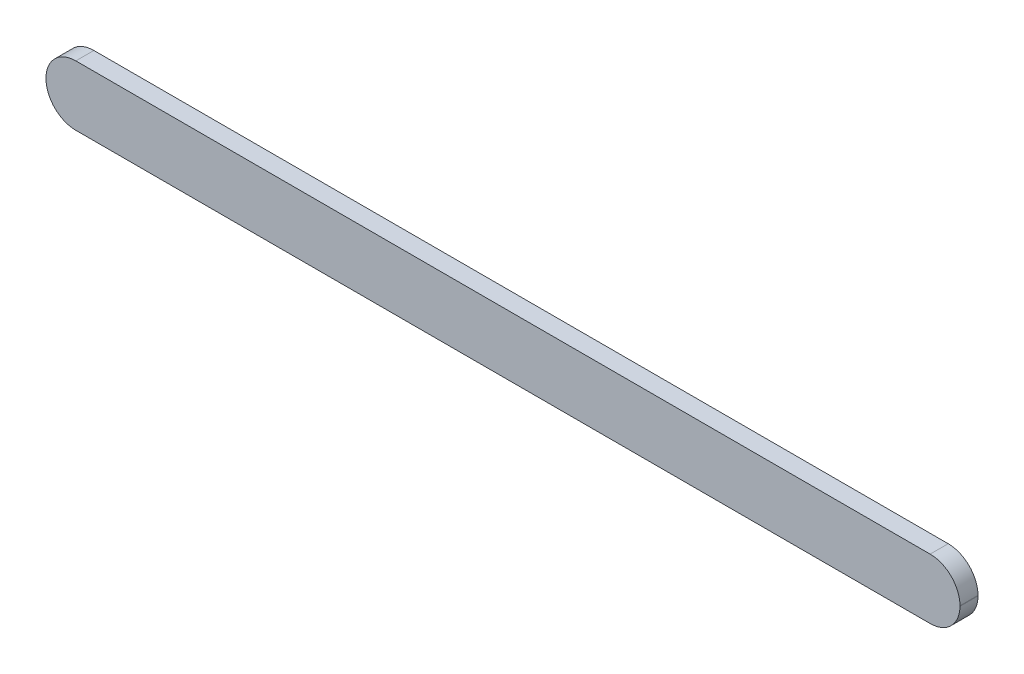
ISO-10303-21;
HEADER;
FILE_DESCRIPTION(('STEP AP214'),'2;1');
FILE_NAME('part.step','',(''),(''),'','','');
FILE_SCHEMA(('AUTOMOTIVE_DESIGN { 1 0 10303 214 1 1 1 1 }'));
ENDSEC;
DATA;
#1=APPLICATION_CONTEXT('core data for automotive mechanical design processes');
#2=APPLICATION_PROTOCOL_DEFINITION('international standard','automotive_design',2000,#1);
#3=PRODUCT_CONTEXT('',#1,'mechanical');
#4=PRODUCT('Part','Part','',(#3));
#5=PRODUCT_RELATED_PRODUCT_CATEGORY('part','',(#4));
#6=PRODUCT_DEFINITION_FORMATION('','',#4);
#7=PRODUCT_DEFINITION_CONTEXT('part definition',#1,'design');
#8=PRODUCT_DEFINITION('design','',#6,#7);
#9=PRODUCT_DEFINITION_SHAPE('','',#8);
#10=(LENGTH_UNIT() NAMED_UNIT(*) SI_UNIT(.MILLI.,.METRE.));
#11=(NAMED_UNIT(*) PLANE_ANGLE_UNIT() SI_UNIT($,.RADIAN.));
#12=(NAMED_UNIT(*) SI_UNIT($,.STERADIAN.) SOLID_ANGLE_UNIT());
#13=UNCERTAINTY_MEASURE_WITH_UNIT(LENGTH_MEASURE(1.E-05),#10,'distance_accuracy_value','');
#14=(GEOMETRIC_REPRESENTATION_CONTEXT(3) GLOBAL_UNCERTAINTY_ASSIGNED_CONTEXT((#13)) GLOBAL_UNIT_ASSIGNED_CONTEXT((#10,
#11,#12)) REPRESENTATION_CONTEXT('',''));
#15=CARTESIAN_POINT('',(0.,0.,0.));
#16=DIRECTION('',(0.,0.,1.));
#17=DIRECTION('',(1.,0.,0.));
#18=AXIS2_PLACEMENT_3D('',#15,#16,#17);
#19=CARTESIAN_POINT('',(933.704,-32.004,0.));
#20=DIRECTION('',(0.,0.,-1.));
#21=DIRECTION('',(-1.,0.,0.));
#22=AXIS2_PLACEMENT_3D('',#19,#20,#21);
#23=PLANE('',#22);
#24=CARTESIAN_POINT('',(241.3,-31.7500000000042,0.));
#25=DIRECTION('',(0.,0.,1.));
#26=DIRECTION('',(1.,0.,0.));
#27=AXIS2_PLACEMENT_3D('',#24,#25,#26);
#28=CIRCLE('',#27,16.66875);
#29=CARTESIAN_POINT('',(257.96875,-31.7500000000042,0.));
#30=VERTEX_POINT('',#29);
#31=EDGE_CURVE('E208',#30,#30,#28,.T.);
#32=ORIENTED_EDGE('',*,*,#31,.T.);
#33=EDGE_LOOP('',(#32));
#34=FACE_BOUND('',#33,.T.);
#35=CARTESIAN_POINT('',(482.6,-31.7500000000025,0.));
#36=DIRECTION('',(0.,0.,1.));
#37=DIRECTION('',(1.,0.,0.));
#38=AXIS2_PLACEMENT_3D('',#35,#36,#37);
#39=CIRCLE('',#38,16.66875);
#40=CARTESIAN_POINT('',(499.26875,-31.7500000000025,0.));
#41=VERTEX_POINT('',#40);
#42=EDGE_CURVE('E196',#41,#41,#39,.T.);
#43=ORIENTED_EDGE('',*,*,#42,.T.);
#44=EDGE_LOOP('',(#43));
#45=FACE_BOUND('',#44,.T.);
#46=CARTESIAN_POINT('',(723.9,-31.7500000000008,0.));
#47=DIRECTION('',(0.,0.,1.));
#48=DIRECTION('',(1.,0.,0.));
#49=AXIS2_PLACEMENT_3D('',#46,#47,#48);
#50=CIRCLE('',#49,16.66875);
#51=CARTESIAN_POINT('',(740.56875,-31.7500000000008,0.));
#52=VERTEX_POINT('',#51);
#53=EDGE_CURVE('E184',#52,#52,#50,.T.);
#54=ORIENTED_EDGE('',*,*,#53,.T.);
#55=EDGE_LOOP('',(#54));
#56=FACE_BOUND('',#55,.T.);
#57=CARTESIAN_POINT('',(933.704,-32.004,0.));
#58=DIRECTION('',(0.,0.,1.));
#59=DIRECTION('',(-1.,0.,0.));
#60=AXIS2_PLACEMENT_3D('',#57,#58,#59);
#61=CIRCLE('',#60,31.4959999999999);
#62=CARTESIAN_POINT('',(933.704,-63.5,0.));
#63=VERTEX_POINT('',#62);
#64=CARTESIAN_POINT('',(965.2,-32.004,0.));
#65=VERTEX_POINT('',#64);
#66=EDGE_CURVE('E130',#63,#65,#61,.T.);
#67=ORIENTED_EDGE('',*,*,#66,.F.);
#68=DIRECTION('',(1.,0.,0.));
#69=VECTOR('',#68,1.);
#70=CARTESIAN_POINT('',(31.496,-63.5,0.));
#71=LINE('',#70,#69);
#72=CARTESIAN_POINT('',(31.496,-63.5,0.));
#73=VERTEX_POINT('',#72);
#74=EDGE_CURVE('E85',#73,#63,#71,.T.);
#75=ORIENTED_EDGE('',*,*,#74,.F.);
#76=CARTESIAN_POINT('',(31.496,-32.004,0.));
#77=DIRECTION('',(0.,0.,1.));
#78=DIRECTION('',(1.,0.,0.));
#79=AXIS2_PLACEMENT_3D('',#76,#77,#78);
#80=CIRCLE('',#79,31.496);
#81=CARTESIAN_POINT('',(0.,-32.004,0.));
#82=VERTEX_POINT('',#81);
#83=EDGE_CURVE('E79',#82,#73,#80,.T.);
#84=ORIENTED_EDGE('',*,*,#83,.F.);
#85=DIRECTION('',(0.,-1.,0.));
#86=VECTOR('',#85,1.);
#87=CARTESIAN_POINT('',(0.,-31.496,0.));
#88=LINE('',#87,#86);
#89=CARTESIAN_POINT('',(0.,-31.496,0.));
#90=VERTEX_POINT('',#89);
#91=EDGE_CURVE('E120',#90,#82,#88,.T.);
#92=ORIENTED_EDGE('',*,*,#91,.F.);
#93=CARTESIAN_POINT('',(31.496,-31.496,0.));
#94=DIRECTION('',(0.,0.,1.));
#95=DIRECTION('',(-1.,0.,0.));
#96=AXIS2_PLACEMENT_3D('',#93,#94,#95);
#97=CIRCLE('',#96,31.496);
#98=CARTESIAN_POINT('',(31.496,0.,0.));
#99=VERTEX_POINT('',#98);
#100=EDGE_CURVE('E140',#99,#90,#97,.T.);
#101=ORIENTED_EDGE('',*,*,#100,.F.);
#102=DIRECTION('',(-1.,0.,0.));
#103=VECTOR('',#102,1.);
#104=CARTESIAN_POINT('',(31.496,0.,0.));
#105=LINE('',#104,#103);
#106=CARTESIAN_POINT('',(933.704,0.,0.));
#107=VERTEX_POINT('',#106);
#108=EDGE_CURVE('E138',#107,#99,#105,.T.);
#109=ORIENTED_EDGE('',*,*,#108,.F.);
#110=CARTESIAN_POINT('',(933.704,-31.496,0.));
#111=DIRECTION('',(0.,0.,1.));
#112=DIRECTION('',(1.,0.,0.));
#113=AXIS2_PLACEMENT_3D('',#110,#111,#112);
#114=CIRCLE('',#113,31.4959999999999);
#115=CARTESIAN_POINT('',(965.2,-31.496,0.));
#116=VERTEX_POINT('',#115);
#117=EDGE_CURVE('E136',#116,#107,#114,.T.);
#118=ORIENTED_EDGE('',*,*,#117,.F.);
#119=DIRECTION('',(0.,1.,0.));
#120=VECTOR('',#119,1.);
#121=CARTESIAN_POINT('',(965.2,-31.496,0.));
#122=LINE('',#121,#120);
#123=EDGE_CURVE('E133',#65,#116,#122,.T.);
#124=ORIENTED_EDGE('',*,*,#123,.F.);
#125=EDGE_LOOP('',(#67,#75,#84,#92,#101,#109,#118,#124));
#126=FACE_BOUND('',#125,.T.);
#127=CARTESIAN_POINT('',(844.55,-31.75,0.));
#128=DIRECTION('',(0.,0.,1.));
#129=DIRECTION('',(1.,0.,0.));
#130=AXIS2_PLACEMENT_3D('',#127,#128,#129);
#131=CIRCLE('',#130,16.66875);
#132=CARTESIAN_POINT('',(861.21875,-31.75,0.));
#133=VERTEX_POINT('',#132);
#134=EDGE_CURVE('E178',#133,#133,#131,.T.);
#135=ORIENTED_EDGE('',*,*,#134,.T.);
#136=EDGE_LOOP('',(#135));
#137=FACE_BOUND('',#136,.T.);
#138=CARTESIAN_POINT('',(603.25,-31.7500000000017,0.));
#139=DIRECTION('',(0.,0.,1.));
#140=DIRECTION('',(1.,0.,0.));
#141=AXIS2_PLACEMENT_3D('',#138,#139,#140);
#142=CIRCLE('',#141,16.66875);
#143=CARTESIAN_POINT('',(619.91875,-31.7500000000017,0.));
#144=VERTEX_POINT('',#143);
#145=EDGE_CURVE('E190',#144,#144,#142,.T.);
#146=ORIENTED_EDGE('',*,*,#145,.T.);
#147=EDGE_LOOP('',(#146));
#148=FACE_BOUND('',#147,.T.);
#149=CARTESIAN_POINT('',(361.95,-31.7500000000034,0.));
#150=DIRECTION('',(0.,0.,1.));
#151=DIRECTION('',(1.,0.,0.));
#152=AXIS2_PLACEMENT_3D('',#149,#150,#151);
#153=CIRCLE('',#152,16.66875);
#154=CARTESIAN_POINT('',(378.61875,-31.7500000000034,0.));
#155=VERTEX_POINT('',#154);
#156=EDGE_CURVE('E202',#155,#155,#153,.T.);
#157=ORIENTED_EDGE('',*,*,#156,.T.);
#158=EDGE_LOOP('',(#157));
#159=FACE_BOUND('',#158,.T.);
#160=CARTESIAN_POINT('',(120.65,-31.750000000005,0.));
#161=DIRECTION('',(0.,0.,1.));
#162=DIRECTION('',(1.,0.,0.));
#163=AXIS2_PLACEMENT_3D('',#160,#161,#162);
#164=CIRCLE('',#163,16.66875);
#165=CARTESIAN_POINT('',(137.31875,-31.750000000005,0.));
#166=VERTEX_POINT('',#165);
#167=EDGE_CURVE('E214',#166,#166,#164,.T.);
#168=ORIENTED_EDGE('',*,*,#167,.T.);
#169=EDGE_LOOP('',(#168));
#170=FACE_BOUND('',#169,.T.);
#171=ADVANCED_FACE('F33',(#34,#45,#56,#126,#137,#148,#159,#170),#23,.T.);
#172=CARTESIAN_POINT('',(933.704,-32.004,19.05));
#173=DIRECTION('',(0.,0.,-1.));
#174=DIRECTION('',(-1.,0.,0.));
#175=AXIS2_PLACEMENT_3D('',#172,#173,#174);
#176=CYLINDRICAL_SURFACE('',#175,31.4959999999999);
#177=ORIENTED_EDGE('',*,*,#66,.T.);
#178=DIRECTION('',(0.,0.,-1.));
#179=VECTOR('',#178,1.);
#180=CARTESIAN_POINT('',(965.2,-32.004,19.05));
#181=LINE('',#180,#179);
#182=CARTESIAN_POINT('',(965.2,-32.004,19.05));
#183=VERTEX_POINT('',#182);
#184=EDGE_CURVE('E11',#183,#65,#181,.T.);
#185=ORIENTED_EDGE('',*,*,#184,.F.);
#186=CARTESIAN_POINT('',(933.704,-32.004,19.05));
#187=DIRECTION('',(0.,0.,1.));
#188=DIRECTION('',(-1.,0.,0.));
#189=AXIS2_PLACEMENT_3D('',#186,#187,#188);
#190=CIRCLE('',#189,31.4959999999999);
#191=CARTESIAN_POINT('',(933.704,-63.5,19.05));
#192=VERTEX_POINT('',#191);
#193=EDGE_CURVE('E145',#192,#183,#190,.T.);
#194=ORIENTED_EDGE('',*,*,#193,.F.);
#195=DIRECTION('',(0.,0.,-1.));
#196=VECTOR('',#195,1.);
#197=CARTESIAN_POINT('',(933.704,-63.5,19.05));
#198=LINE('',#197,#196);
#199=EDGE_CURVE('E126',#192,#63,#198,.T.);
#200=ORIENTED_EDGE('',*,*,#199,.T.);
#201=EDGE_LOOP('',(#177,#185,#194,#200));
#202=FACE_BOUND('',#201,.T.);
#203=ADVANCED_FACE('F35',(#202),#176,.T.);
#204=CARTESIAN_POINT('',(965.2,-31.496,19.05));
#205=DIRECTION('',(-1.,0.,0.));
#206=DIRECTION('',(0.,0.,1.));
#207=AXIS2_PLACEMENT_3D('',#204,#205,#206);
#208=PLANE('',#207);
#209=ORIENTED_EDGE('',*,*,#123,.T.);
#210=DIRECTION('',(0.,0.,-1.));
#211=VECTOR('',#210,1.);
#212=CARTESIAN_POINT('',(965.2,-31.496,19.05));
#213=LINE('',#212,#211);
#214=CARTESIAN_POINT('',(965.2,-31.496,19.05));
#215=VERTEX_POINT('',#214);
#216=EDGE_CURVE('E42',#215,#116,#213,.T.);
#217=ORIENTED_EDGE('',*,*,#216,.F.);
#218=DIRECTION('',(0.,1.,0.));
#219=VECTOR('',#218,1.);
#220=CARTESIAN_POINT('',(965.2,-31.496,19.05));
#221=LINE('',#220,#219);
#222=EDGE_CURVE('E93',#183,#215,#221,.T.);
#223=ORIENTED_EDGE('',*,*,#222,.F.);
#224=ORIENTED_EDGE('',*,*,#184,.T.);
#225=EDGE_LOOP('',(#209,#217,#223,#224));
#226=FACE_BOUND('',#225,.T.);
#227=ADVANCED_FACE('F237',(#226),#208,.F.);
#228=CARTESIAN_POINT('',(933.704,-31.496,19.05));
#229=DIRECTION('',(0.,0.,-1.));
#230=DIRECTION('',(-1.,0.,0.));
#231=AXIS2_PLACEMENT_3D('',#228,#229,#230);
#232=CYLINDRICAL_SURFACE('',#231,31.4959999999999);
#233=ORIENTED_EDGE('',*,*,#117,.T.);
#234=DIRECTION('',(0.,0.,-1.));
#235=VECTOR('',#234,1.);
#236=CARTESIAN_POINT('',(933.704,0.,19.05));
#237=LINE('',#236,#235);
#238=CARTESIAN_POINT('',(933.704,0.,19.05));
#239=VERTEX_POINT('',#238);
#240=EDGE_CURVE('E152',#239,#107,#237,.T.);
#241=ORIENTED_EDGE('',*,*,#240,.F.);
#242=CARTESIAN_POINT('',(933.704,-31.496,19.05));
#243=DIRECTION('',(0.,0.,1.));
#244=DIRECTION('',(1.,0.,0.));
#245=AXIS2_PLACEMENT_3D('',#242,#243,#244);
#246=CIRCLE('',#245,31.4959999999999);
#247=EDGE_CURVE('E160',#215,#239,#246,.T.);
#248=ORIENTED_EDGE('',*,*,#247,.F.);
#249=ORIENTED_EDGE('',*,*,#216,.T.);
#250=EDGE_LOOP('',(#233,#241,#248,#249));
#251=FACE_BOUND('',#250,.T.);
#252=ADVANCED_FACE('F158',(#251),#232,.T.);
#253=CARTESIAN_POINT('',(31.496,0.,19.05));
#254=DIRECTION('',(0.,-1.,0.));
#255=DIRECTION('',(0.,0.,-1.));
#256=AXIS2_PLACEMENT_3D('',#253,#254,#255);
#257=PLANE('',#256);
#258=ORIENTED_EDGE('',*,*,#108,.T.);
#259=DIRECTION('',(0.,0.,-1.));
#260=VECTOR('',#259,1.);
#261=CARTESIAN_POINT('',(31.496,0.,19.05));
#262=LINE('',#261,#260);
#263=CARTESIAN_POINT('',(31.496,0.,19.05));
#264=VERTEX_POINT('',#263);
#265=EDGE_CURVE('E149',#264,#99,#262,.T.);
#266=ORIENTED_EDGE('',*,*,#265,.F.);
#267=DIRECTION('',(-1.,0.,0.));
#268=VECTOR('',#267,1.);
#269=CARTESIAN_POINT('',(31.496,0.,19.05));
#270=LINE('',#269,#268);
#271=EDGE_CURVE('E172',#239,#264,#270,.T.);
#272=ORIENTED_EDGE('',*,*,#271,.F.);
#273=ORIENTED_EDGE('',*,*,#240,.T.);
#274=EDGE_LOOP('',(#258,#266,#272,#273));
#275=FACE_BOUND('',#274,.T.);
#276=ADVANCED_FACE('F168',(#275),#257,.F.);
#277=CARTESIAN_POINT('',(31.496,-31.496,19.05));
#278=DIRECTION('',(0.,0.,-1.));
#279=DIRECTION('',(-1.,0.,0.));
#280=AXIS2_PLACEMENT_3D('',#277,#278,#279);
#281=CYLINDRICAL_SURFACE('',#280,31.496);
#282=ORIENTED_EDGE('',*,*,#100,.T.);
#283=DIRECTION('',(0.,0.,-1.));
#284=VECTOR('',#283,1.);
#285=CARTESIAN_POINT('',(0.,-31.496,19.05));
#286=LINE('',#285,#284);
#287=CARTESIAN_POINT('',(0.,-31.496,19.05));
#288=VERTEX_POINT('',#287);
#289=EDGE_CURVE('E121',#288,#90,#286,.T.);
#290=ORIENTED_EDGE('',*,*,#289,.F.);
#291=CARTESIAN_POINT('',(31.496,-31.496,19.05));
#292=DIRECTION('',(0.,0.,1.));
#293=DIRECTION('',(-1.,0.,0.));
#294=AXIS2_PLACEMENT_3D('',#291,#292,#293);
#295=CIRCLE('',#294,31.496);
#296=EDGE_CURVE('E112',#264,#288,#295,.T.);
#297=ORIENTED_EDGE('',*,*,#296,.F.);
#298=ORIENTED_EDGE('',*,*,#265,.T.);
#299=EDGE_LOOP('',(#282,#290,#297,#298));
#300=FACE_BOUND('',#299,.T.);
#301=ADVANCED_FACE('F171',(#300),#281,.T.);
#302=CARTESIAN_POINT('',(0.,-31.496,19.05));
#303=DIRECTION('',(1.,0.,0.));
#304=DIRECTION('',(0.,0.,-1.));
#305=AXIS2_PLACEMENT_3D('',#302,#303,#304);
#306=PLANE('',#305);
#307=ORIENTED_EDGE('',*,*,#91,.T.);
#308=DIRECTION('',(0.,0.,-1.));
#309=VECTOR('',#308,1.);
#310=CARTESIAN_POINT('',(0.,-32.004,19.05));
#311=LINE('',#310,#309);
#312=CARTESIAN_POINT('',(0.,-32.004,19.05));
#313=VERTEX_POINT('',#312);
#314=EDGE_CURVE('E117',#313,#82,#311,.T.);
#315=ORIENTED_EDGE('',*,*,#314,.F.);
#316=DIRECTION('',(0.,-1.,0.));
#317=VECTOR('',#316,1.);
#318=CARTESIAN_POINT('',(0.,-31.496,19.05));
#319=LINE('',#318,#317);
#320=EDGE_CURVE('E106',#288,#313,#319,.T.);
#321=ORIENTED_EDGE('',*,*,#320,.F.);
#322=ORIENTED_EDGE('',*,*,#289,.T.);
#323=EDGE_LOOP('',(#307,#315,#321,#322));
#324=FACE_BOUND('',#323,.T.);
#325=ADVANCED_FACE('F118',(#324),#306,.F.);
#326=CARTESIAN_POINT('',(31.496,-32.004,19.05));
#327=DIRECTION('',(0.,0.,-1.));
#328=DIRECTION('',(-1.,0.,0.));
#329=AXIS2_PLACEMENT_3D('',#326,#327,#328);
#330=CYLINDRICAL_SURFACE('',#329,31.496);
#331=ORIENTED_EDGE('',*,*,#83,.T.);
#332=DIRECTION('',(0.,0.,-1.));
#333=VECTOR('',#332,1.);
#334=CARTESIAN_POINT('',(31.496,-63.5,19.05));
#335=LINE('',#334,#333);
#336=CARTESIAN_POINT('',(31.496,-63.5,19.05));
#337=VERTEX_POINT('',#336);
#338=EDGE_CURVE('E122',#337,#73,#335,.T.);
#339=ORIENTED_EDGE('',*,*,#338,.F.);
#340=CARTESIAN_POINT('',(31.496,-32.004,19.05));
#341=DIRECTION('',(0.,0.,1.));
#342=DIRECTION('',(1.,0.,0.));
#343=AXIS2_PLACEMENT_3D('',#340,#341,#342);
#344=CIRCLE('',#343,31.496);
#345=EDGE_CURVE('E110',#313,#337,#344,.T.);
#346=ORIENTED_EDGE('',*,*,#345,.F.);
#347=ORIENTED_EDGE('',*,*,#314,.T.);
#348=EDGE_LOOP('',(#331,#339,#346,#347));
#349=FACE_BOUND('',#348,.T.);
#350=ADVANCED_FACE('F124',(#349),#330,.T.);
#351=CARTESIAN_POINT('',(31.496,-63.5,19.05));
#352=DIRECTION('',(0.,1.,0.));
#353=DIRECTION('',(-1.,0.,0.));
#354=AXIS2_PLACEMENT_3D('',#351,#352,#353);
#355=PLANE('',#354);
#356=ORIENTED_EDGE('',*,*,#74,.T.);
#357=ORIENTED_EDGE('',*,*,#199,.F.);
#358=DIRECTION('',(1.,0.,0.));
#359=VECTOR('',#358,1.);
#360=CARTESIAN_POINT('',(31.496,-63.5,19.05));
#361=LINE('',#360,#359);
#362=EDGE_CURVE('E50',#337,#192,#361,.T.);
#363=ORIENTED_EDGE('',*,*,#362,.F.);
#364=ORIENTED_EDGE('',*,*,#338,.T.);
#365=EDGE_LOOP('',(#356,#357,#363,#364));
#366=FACE_BOUND('',#365,.T.);
#367=ADVANCED_FACE('F243',(#366),#355,.F.);
#368=CARTESIAN_POINT('',(933.704,-32.004,19.05));
#369=DIRECTION('',(0.,0.,-1.));
#370=DIRECTION('',(-1.,0.,0.));
#371=AXIS2_PLACEMENT_3D('',#368,#369,#370);
#372=PLANE('',#371);
#373=ORIENTED_EDGE('',*,*,#193,.T.);
#374=ORIENTED_EDGE('',*,*,#222,.T.);
#375=ORIENTED_EDGE('',*,*,#247,.T.);
#376=ORIENTED_EDGE('',*,*,#271,.T.);
#377=ORIENTED_EDGE('',*,*,#296,.T.);
#378=ORIENTED_EDGE('',*,*,#320,.T.);
#379=ORIENTED_EDGE('',*,*,#345,.T.);
#380=ORIENTED_EDGE('',*,*,#362,.T.);
#381=EDGE_LOOP('',(#373,#374,#375,#376,#377,#378,#379,#380));
#382=FACE_BOUND('',#381,.T.);
#383=ADVANCED_FACE('F108',(#382),#372,.F.);
#384=CARTESIAN_POINT('',(844.55,-31.75,9.525));
#385=DIRECTION('',(0.,0.,-1.));
#386=DIRECTION('',(-1.,0.,0.));
#387=AXIS2_PLACEMENT_3D('',#384,#385,#386);
#388=CYLINDRICAL_SURFACE('',#387,16.66875);
#389=CARTESIAN_POINT('',(844.55,-31.75,9.525));
#390=DIRECTION('',(0.,0.,1.));
#391=DIRECTION('',(1.,0.,0.));
#392=AXIS2_PLACEMENT_3D('',#389,#390,#391);
#393=CIRCLE('',#392,16.66875);
#394=CARTESIAN_POINT('',(861.21875,-31.75,9.525));
#395=VERTEX_POINT('',#394);
#396=EDGE_CURVE('E134',#395,#395,#393,.T.);
#397=ORIENTED_EDGE('',*,*,#396,.T.);
#398=EDGE_LOOP('',(#397));
#399=FACE_BOUND('',#398,.T.);
#400=ORIENTED_EDGE('',*,*,#134,.F.);
#401=EDGE_LOOP('',(#400));
#402=FACE_BOUND('',#401,.T.);
#403=ADVANCED_FACE('F292',(#399,#402),#388,.F.);
#404=CARTESIAN_POINT('',(844.55,-31.75,9.525));
#405=DIRECTION('',(0.,0.,1.));
#406=DIRECTION('',(1.,0.,0.));
#407=AXIS2_PLACEMENT_3D('',#404,#405,#406);
#408=PLANE('',#407);
#409=ORIENTED_EDGE('',*,*,#396,.F.);
#410=EDGE_LOOP('',(#409));
#411=FACE_BOUND('',#410,.T.);
#412=ADVANCED_FACE('F298',(#411),#408,.F.);
#413=CARTESIAN_POINT('',(723.9,-31.7500000000008,9.525));
#414=DIRECTION('',(0.,0.,-1.));
#415=DIRECTION('',(-1.,0.,0.));
#416=AXIS2_PLACEMENT_3D('',#413,#414,#415);
#417=CYLINDRICAL_SURFACE('',#416,16.66875);
#418=CARTESIAN_POINT('',(723.9,-31.7500000000008,9.525));
#419=DIRECTION('',(0.,0.,1.));
#420=DIRECTION('',(1.,0.,0.));
#421=AXIS2_PLACEMENT_3D('',#418,#419,#420);
#422=CIRCLE('',#421,16.66875);
#423=CARTESIAN_POINT('',(740.56875,-31.7500000000008,9.525));
#424=VERTEX_POINT('',#423);
#425=EDGE_CURVE('E181',#424,#424,#422,.T.);
#426=ORIENTED_EDGE('',*,*,#425,.T.);
#427=EDGE_LOOP('',(#426));
#428=FACE_BOUND('',#427,.T.);
#429=ORIENTED_EDGE('',*,*,#53,.F.);
#430=EDGE_LOOP('',(#429));
#431=FACE_BOUND('',#430,.T.);
#432=ADVANCED_FACE('F305',(#428,#431),#417,.F.);
#433=CARTESIAN_POINT('',(723.9,-31.7500000000008,9.525));
#434=DIRECTION('',(0.,0.,1.));
#435=DIRECTION('',(1.,0.,0.));
#436=AXIS2_PLACEMENT_3D('',#433,#434,#435);
#437=PLANE('',#436);
#438=ORIENTED_EDGE('',*,*,#425,.F.);
#439=EDGE_LOOP('',(#438));
#440=FACE_BOUND('',#439,.T.);
#441=ADVANCED_FACE('F313',(#440),#437,.F.);
#442=CARTESIAN_POINT('',(603.25,-31.7500000000017,9.525));
#443=DIRECTION('',(0.,0.,-1.));
#444=DIRECTION('',(-1.,0.,0.));
#445=AXIS2_PLACEMENT_3D('',#442,#443,#444);
#446=CYLINDRICAL_SURFACE('',#445,16.66875);
#447=CARTESIAN_POINT('',(603.25,-31.7500000000017,9.525));
#448=DIRECTION('',(0.,0.,1.));
#449=DIRECTION('',(1.,0.,0.));
#450=AXIS2_PLACEMENT_3D('',#447,#448,#449);
#451=CIRCLE('',#450,16.66875);
#452=CARTESIAN_POINT('',(619.91875,-31.7500000000017,9.525));
#453=VERTEX_POINT('',#452);
#454=EDGE_CURVE('E187',#453,#453,#451,.T.);
#455=ORIENTED_EDGE('',*,*,#454,.T.);
#456=EDGE_LOOP('',(#455));
#457=FACE_BOUND('',#456,.T.);
#458=ORIENTED_EDGE('',*,*,#145,.F.);
#459=EDGE_LOOP('',(#458));
#460=FACE_BOUND('',#459,.T.);
#461=ADVANCED_FACE('F321',(#457,#460),#446,.F.);
#462=CARTESIAN_POINT('',(603.25,-31.7500000000017,9.525));
#463=DIRECTION('',(0.,0.,1.));
#464=DIRECTION('',(1.,0.,0.));
#465=AXIS2_PLACEMENT_3D('',#462,#463,#464);
#466=PLANE('',#465);
#467=ORIENTED_EDGE('',*,*,#454,.F.);
#468=EDGE_LOOP('',(#467));
#469=FACE_BOUND('',#468,.T.);
#470=ADVANCED_FACE('F329',(#469),#466,.F.);
#471=CARTESIAN_POINT('',(482.6,-31.7500000000025,9.525));
#472=DIRECTION('',(0.,0.,-1.));
#473=DIRECTION('',(-1.,0.,0.));
#474=AXIS2_PLACEMENT_3D('',#471,#472,#473);
#475=CYLINDRICAL_SURFACE('',#474,16.66875);
#476=CARTESIAN_POINT('',(482.6,-31.7500000000025,9.525));
#477=DIRECTION('',(0.,0.,1.));
#478=DIRECTION('',(1.,0.,0.));
#479=AXIS2_PLACEMENT_3D('',#476,#477,#478);
#480=CIRCLE('',#479,16.66875);
#481=CARTESIAN_POINT('',(499.26875,-31.7500000000025,9.525));
#482=VERTEX_POINT('',#481);
#483=EDGE_CURVE('E193',#482,#482,#480,.T.);
#484=ORIENTED_EDGE('',*,*,#483,.T.);
#485=EDGE_LOOP('',(#484));
#486=FACE_BOUND('',#485,.T.);
#487=ORIENTED_EDGE('',*,*,#42,.F.);
#488=EDGE_LOOP('',(#487));
#489=FACE_BOUND('',#488,.T.);
#490=ADVANCED_FACE('F337',(#486,#489),#475,.F.);
#491=CARTESIAN_POINT('',(482.6,-31.7500000000025,9.525));
#492=DIRECTION('',(0.,0.,1.));
#493=DIRECTION('',(1.,0.,0.));
#494=AXIS2_PLACEMENT_3D('',#491,#492,#493);
#495=PLANE('',#494);
#496=ORIENTED_EDGE('',*,*,#483,.F.);
#497=EDGE_LOOP('',(#496));
#498=FACE_BOUND('',#497,.T.);
#499=ADVANCED_FACE('F345',(#498),#495,.F.);
#500=CARTESIAN_POINT('',(361.95,-31.7500000000034,9.525));
#501=DIRECTION('',(0.,0.,-1.));
#502=DIRECTION('',(-1.,0.,0.));
#503=AXIS2_PLACEMENT_3D('',#500,#501,#502);
#504=CYLINDRICAL_SURFACE('',#503,16.66875);
#505=CARTESIAN_POINT('',(361.95,-31.7500000000034,9.525));
#506=DIRECTION('',(0.,0.,1.));
#507=DIRECTION('',(1.,0.,0.));
#508=AXIS2_PLACEMENT_3D('',#505,#506,#507);
#509=CIRCLE('',#508,16.66875);
#510=CARTESIAN_POINT('',(378.61875,-31.7500000000034,9.525));
#511=VERTEX_POINT('',#510);
#512=EDGE_CURVE('E199',#511,#511,#509,.T.);
#513=ORIENTED_EDGE('',*,*,#512,.T.);
#514=EDGE_LOOP('',(#513));
#515=FACE_BOUND('',#514,.T.);
#516=ORIENTED_EDGE('',*,*,#156,.F.);
#517=EDGE_LOOP('',(#516));
#518=FACE_BOUND('',#517,.T.);
#519=ADVANCED_FACE('F353',(#515,#518),#504,.F.);
#520=CARTESIAN_POINT('',(361.95,-31.7500000000034,9.525));
#521=DIRECTION('',(0.,0.,1.));
#522=DIRECTION('',(1.,0.,0.));
#523=AXIS2_PLACEMENT_3D('',#520,#521,#522);
#524=PLANE('',#523);
#525=ORIENTED_EDGE('',*,*,#512,.F.);
#526=EDGE_LOOP('',(#525));
#527=FACE_BOUND('',#526,.T.);
#528=ADVANCED_FACE('F361',(#527),#524,.F.);
#529=CARTESIAN_POINT('',(241.3,-31.7500000000042,9.525));
#530=DIRECTION('',(0.,0.,-1.));
#531=DIRECTION('',(-1.,0.,0.));
#532=AXIS2_PLACEMENT_3D('',#529,#530,#531);
#533=CYLINDRICAL_SURFACE('',#532,16.66875);
#534=CARTESIAN_POINT('',(241.3,-31.7500000000042,9.525));
#535=DIRECTION('',(0.,0.,1.));
#536=DIRECTION('',(1.,0.,0.));
#537=AXIS2_PLACEMENT_3D('',#534,#535,#536);
#538=CIRCLE('',#537,16.66875);
#539=CARTESIAN_POINT('',(257.96875,-31.7500000000042,9.525));
#540=VERTEX_POINT('',#539);
#541=EDGE_CURVE('E205',#540,#540,#538,.T.);
#542=ORIENTED_EDGE('',*,*,#541,.T.);
#543=EDGE_LOOP('',(#542));
#544=FACE_BOUND('',#543,.T.);
#545=ORIENTED_EDGE('',*,*,#31,.F.);
#546=EDGE_LOOP('',(#545));
#547=FACE_BOUND('',#546,.T.);
#548=ADVANCED_FACE('F369',(#544,#547),#533,.F.);
#549=CARTESIAN_POINT('',(241.3,-31.7500000000042,9.525));
#550=DIRECTION('',(0.,0.,1.));
#551=DIRECTION('',(1.,0.,0.));
#552=AXIS2_PLACEMENT_3D('',#549,#550,#551);
#553=PLANE('',#552);
#554=ORIENTED_EDGE('',*,*,#541,.F.);
#555=EDGE_LOOP('',(#554));
#556=FACE_BOUND('',#555,.T.);
#557=ADVANCED_FACE('F229',(#556),#553,.F.);
#558=CARTESIAN_POINT('',(120.65,-31.750000000005,9.525));
#559=DIRECTION('',(0.,0.,-1.));
#560=DIRECTION('',(-1.,0.,0.));
#561=AXIS2_PLACEMENT_3D('',#558,#559,#560);
#562=CYLINDRICAL_SURFACE('',#561,16.66875);
#563=CARTESIAN_POINT('',(120.65,-31.750000000005,9.525));
#564=DIRECTION('',(0.,0.,1.));
#565=DIRECTION('',(1.,0.,0.));
#566=AXIS2_PLACEMENT_3D('',#563,#564,#565);
#567=CIRCLE('',#566,16.66875);
#568=CARTESIAN_POINT('',(137.31875,-31.750000000005,9.525));
#569=VERTEX_POINT('',#568);
#570=EDGE_CURVE('E211',#569,#569,#567,.T.);
#571=ORIENTED_EDGE('',*,*,#570,.T.);
#572=EDGE_LOOP('',(#571));
#573=FACE_BOUND('',#572,.T.);
#574=ORIENTED_EDGE('',*,*,#167,.F.);
#575=EDGE_LOOP('',(#574));
#576=FACE_BOUND('',#575,.T.);
#577=ADVANCED_FACE('F220',(#573,#576),#562,.F.);
#578=CARTESIAN_POINT('',(120.65,-31.750000000005,9.525));
#579=DIRECTION('',(0.,0.,1.));
#580=DIRECTION('',(1.,0.,0.));
#581=AXIS2_PLACEMENT_3D('',#578,#579,#580);
#582=PLANE('',#581);
#583=ORIENTED_EDGE('',*,*,#570,.F.);
#584=EDGE_LOOP('',(#583));
#585=FACE_BOUND('',#584,.T.);
#586=ADVANCED_FACE('F223',(#585),#582,.F.);
#587=CLOSED_SHELL('',(#171,#203,#227,#252,#276,#301,#325,#350,#367,#383,#403,#412,#432,#441,
#461,#470,#490,#499,#519,#528,#548,#557,#577,#586));
#588=MANIFOLD_SOLID_BREP('B2',#587);
#589=ADVANCED_BREP_SHAPE_REPRESENTATION('',(#18,#588),#14);
#590=SHAPE_DEFINITION_REPRESENTATION(#9,#589);
ENDSEC;
END-ISO-10303-21;
